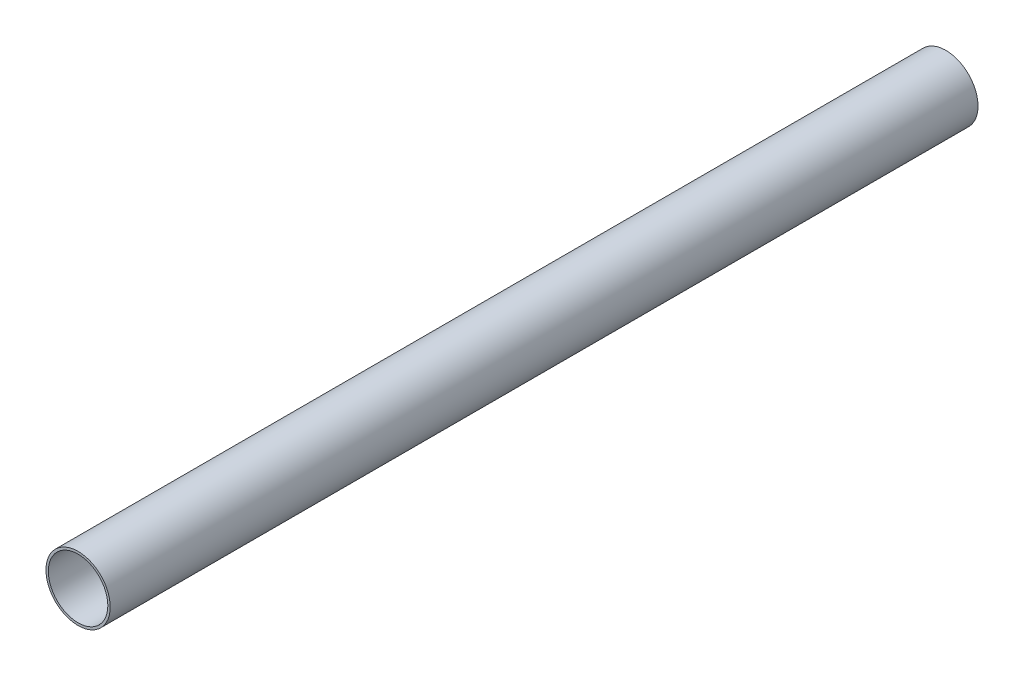
ISO-10303-21;
HEADER;
FILE_DESCRIPTION(('STEP AP214'),'2;1');
FILE_NAME('part.step','',(''),(''),'','','');
FILE_SCHEMA(('AUTOMOTIVE_DESIGN { 1 0 10303 214 1 1 1 1 }'));
ENDSEC;
DATA;
#1=APPLICATION_CONTEXT('core data for automotive mechanical design processes');
#2=APPLICATION_PROTOCOL_DEFINITION('international standard','automotive_design',2000,#1);
#3=PRODUCT_CONTEXT('',#1,'mechanical');
#4=PRODUCT('Part','Part','',(#3));
#5=PRODUCT_RELATED_PRODUCT_CATEGORY('part','',(#4));
#6=PRODUCT_DEFINITION_FORMATION('','',#4);
#7=PRODUCT_DEFINITION_CONTEXT('part definition',#1,'design');
#8=PRODUCT_DEFINITION('design','',#6,#7);
#9=PRODUCT_DEFINITION_SHAPE('','',#8);
#10=(LENGTH_UNIT() NAMED_UNIT(*) SI_UNIT(.MILLI.,.METRE.));
#11=(NAMED_UNIT(*) PLANE_ANGLE_UNIT() SI_UNIT($,.RADIAN.));
#12=(NAMED_UNIT(*) SI_UNIT($,.STERADIAN.) SOLID_ANGLE_UNIT());
#13=UNCERTAINTY_MEASURE_WITH_UNIT(LENGTH_MEASURE(1.E-05),#10,'distance_accuracy_value','');
#14=(GEOMETRIC_REPRESENTATION_CONTEXT(3) GLOBAL_UNCERTAINTY_ASSIGNED_CONTEXT((#13)) GLOBAL_UNIT_ASSIGNED_CONTEXT((#10,
#11,#12)) REPRESENTATION_CONTEXT('',''));
#15=CARTESIAN_POINT('',(0.,0.,0.));
#16=DIRECTION('',(0.,0.,1.));
#17=DIRECTION('',(1.,0.,0.));
#18=AXIS2_PLACEMENT_3D('',#15,#16,#17);
#19=CARTESIAN_POINT('',(0.,0.,5486.4));
#20=DIRECTION('',(0.,0.,1.));
#21=DIRECTION('',(1.,0.,0.));
#22=AXIS2_PLACEMENT_3D('',#19,#20,#21);
#23=PLANE('',#22);
#24=CARTESIAN_POINT('',(0.,0.,5486.4));
#25=DIRECTION('',(0.,0.,1.));
#26=DIRECTION('',(1.,0.,0.));
#27=AXIS2_PLACEMENT_3D('',#24,#25,#26);
#28=CIRCLE('',#27,203.2);
#29=CARTESIAN_POINT('',(203.2,0.,5486.4));
#30=VERTEX_POINT('',#29);
#31=EDGE_CURVE('E10',#30,#30,#28,.T.);
#32=ORIENTED_EDGE('',*,*,#31,.T.);
#33=EDGE_LOOP('',(#32));
#34=FACE_BOUND('',#33,.T.);
#35=CARTESIAN_POINT('',(0.,0.,5486.4));
#36=DIRECTION('',(0.,0.,1.));
#37=DIRECTION('',(1.,0.,0.));
#38=AXIS2_PLACEMENT_3D('',#35,#36,#37);
#39=CIRCLE('',#38,188.1124);
#40=CARTESIAN_POINT('',(188.1124,0.,5486.4));
#41=VERTEX_POINT('',#40);
#42=EDGE_CURVE('E39',#41,#41,#39,.T.);
#43=ORIENTED_EDGE('',*,*,#42,.F.);
#44=EDGE_LOOP('',(#43));
#45=FACE_BOUND('',#44,.T.);
#46=ADVANCED_FACE('F28',(#34,#45),#23,.T.);
#47=CARTESIAN_POINT('',(0.,0.,0.));
#48=DIRECTION('',(0.,0.,1.));
#49=DIRECTION('',(1.,0.,0.));
#50=AXIS2_PLACEMENT_3D('',#47,#48,#49);
#51=PLANE('',#50);
#52=CARTESIAN_POINT('',(0.,0.,0.));
#53=DIRECTION('',(0.,0.,1.));
#54=DIRECTION('',(1.,0.,0.));
#55=AXIS2_PLACEMENT_3D('',#52,#53,#54);
#56=CIRCLE('',#55,203.2);
#57=CARTESIAN_POINT('',(203.2,0.,0.));
#58=VERTEX_POINT('',#57);
#59=EDGE_CURVE('E32',#58,#58,#56,.T.);
#60=ORIENTED_EDGE('',*,*,#59,.F.);
#61=EDGE_LOOP('',(#60));
#62=FACE_BOUND('',#61,.T.);
#63=CARTESIAN_POINT('',(0.,0.,0.));
#64=DIRECTION('',(0.,0.,1.));
#65=DIRECTION('',(1.,0.,0.));
#66=AXIS2_PLACEMENT_3D('',#63,#64,#65);
#67=CIRCLE('',#66,188.1124);
#68=CARTESIAN_POINT('',(188.1124,0.,0.));
#69=VERTEX_POINT('',#68);
#70=EDGE_CURVE('E41',#69,#69,#67,.T.);
#71=ORIENTED_EDGE('',*,*,#70,.T.);
#72=EDGE_LOOP('',(#71));
#73=FACE_BOUND('',#72,.T.);
#74=ADVANCED_FACE('F51',(#62,#73),#51,.F.);
#75=CARTESIAN_POINT('',(0.,0.,5486.4));
#76=DIRECTION('',(0.,0.,-1.));
#77=DIRECTION('',(-1.,0.,0.));
#78=AXIS2_PLACEMENT_3D('',#75,#76,#77);
#79=CYLINDRICAL_SURFACE('',#78,203.2);
#80=ORIENTED_EDGE('',*,*,#31,.F.);
#81=EDGE_LOOP('',(#80));
#82=FACE_BOUND('',#81,.T.);
#83=ORIENTED_EDGE('',*,*,#59,.T.);
#84=EDGE_LOOP('',(#83));
#85=FACE_BOUND('',#84,.T.);
#86=ADVANCED_FACE('F30',(#82,#85),#79,.T.);
#87=CARTESIAN_POINT('',(0.,0.,5486.4));
#88=DIRECTION('',(0.,0.,-1.));
#89=DIRECTION('',(-1.,0.,0.));
#90=AXIS2_PLACEMENT_3D('',#87,#88,#89);
#91=CYLINDRICAL_SURFACE('',#90,188.1124);
#92=ORIENTED_EDGE('',*,*,#42,.T.);
#93=EDGE_LOOP('',(#92));
#94=FACE_BOUND('',#93,.T.);
#95=ORIENTED_EDGE('',*,*,#70,.F.);
#96=EDGE_LOOP('',(#95));
#97=FACE_BOUND('',#96,.T.);
#98=ADVANCED_FACE('F47',(#94,#97),#91,.F.);
#99=CLOSED_SHELL('',(#46,#74,#86,#98));
#100=MANIFOLD_SOLID_BREP('B2',#99);
#101=ADVANCED_BREP_SHAPE_REPRESENTATION('',(#18,#100),#14);
#102=SHAPE_DEFINITION_REPRESENTATION(#9,#101);
ENDSEC;
END-ISO-10303-21;
